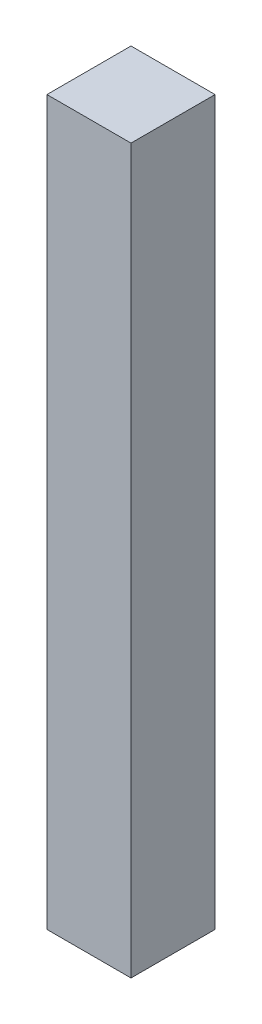
ISO-10303-21;
HEADER;
FILE_DESCRIPTION(('STEP AP214'),'2;1');
FILE_NAME('part.step','',(''),(''),'','','');
FILE_SCHEMA(('AUTOMOTIVE_DESIGN { 1 0 10303 214 1 1 1 1 }'));
ENDSEC;
DATA;
#1=APPLICATION_CONTEXT('core data for automotive mechanical design processes');
#2=APPLICATION_PROTOCOL_DEFINITION('international standard','automotive_design',2000,#1);
#3=PRODUCT_CONTEXT('',#1,'mechanical');
#4=PRODUCT('Part','Part','',(#3));
#5=PRODUCT_RELATED_PRODUCT_CATEGORY('part','',(#4));
#6=PRODUCT_DEFINITION_FORMATION('','',#4);
#7=PRODUCT_DEFINITION_CONTEXT('part definition',#1,'design');
#8=PRODUCT_DEFINITION('design','',#6,#7);
#9=PRODUCT_DEFINITION_SHAPE('','',#8);
#10=(LENGTH_UNIT() NAMED_UNIT(*) SI_UNIT(.MILLI.,.METRE.));
#11=(NAMED_UNIT(*) PLANE_ANGLE_UNIT() SI_UNIT($,.RADIAN.));
#12=(NAMED_UNIT(*) SI_UNIT($,.STERADIAN.) SOLID_ANGLE_UNIT());
#13=UNCERTAINTY_MEASURE_WITH_UNIT(LENGTH_MEASURE(1.E-05),#10,'distance_accuracy_value','');
#14=(GEOMETRIC_REPRESENTATION_CONTEXT(3) GLOBAL_UNCERTAINTY_ASSIGNED_CONTEXT((#13)) GLOBAL_UNIT_ASSIGNED_CONTEXT((#10,
#11,#12)) REPRESENTATION_CONTEXT('',''));
#15=CARTESIAN_POINT('',(0.,0.,0.));
#16=DIRECTION('',(0.,0.,1.));
#17=DIRECTION('',(1.,0.,0.));
#18=AXIS2_PLACEMENT_3D('',#15,#16,#17);
#19=CARTESIAN_POINT('',(0.,86.,0.));
#20=DIRECTION('',(1.,0.,0.));
#21=DIRECTION('',(0.,0.,-1.));
#22=AXIS2_PLACEMENT_3D('',#19,#20,#21);
#23=PLANE('',#22);
#24=DIRECTION('',(0.,0.,1.));
#25=VECTOR('',#24,1.);
#26=CARTESIAN_POINT('',(0.,0.,0.));
#27=LINE('',#26,#25);
#28=CARTESIAN_POINT('',(0.,0.,0.));
#29=VERTEX_POINT('',#28);
#30=CARTESIAN_POINT('',(0.,0.,10.));
#31=VERTEX_POINT('',#30);
#32=EDGE_CURVE('E96',#29,#31,#27,.T.);
#33=ORIENTED_EDGE('',*,*,#32,.T.);
#34=DIRECTION('',(0.,-1.,0.));
#35=VECTOR('',#34,1.);
#36=CARTESIAN_POINT('',(0.,86.,10.));
#37=LINE('',#36,#35);
#38=CARTESIAN_POINT('',(0.,86.,10.));
#39=VERTEX_POINT('',#38);
#40=EDGE_CURVE('E11',#39,#31,#37,.T.);
#41=ORIENTED_EDGE('',*,*,#40,.F.);
#42=DIRECTION('',(0.,0.,1.));
#43=VECTOR('',#42,1.);
#44=CARTESIAN_POINT('',(0.,86.,0.));
#45=LINE('',#44,#43);
#46=CARTESIAN_POINT('',(0.,86.,0.));
#47=VERTEX_POINT('',#46);
#48=EDGE_CURVE('E84',#47,#39,#45,.T.);
#49=ORIENTED_EDGE('',*,*,#48,.F.);
#50=DIRECTION('',(0.,-1.,0.));
#51=VECTOR('',#50,1.);
#52=CARTESIAN_POINT('',(0.,86.,0.));
#53=LINE('',#52,#51);
#54=EDGE_CURVE('E92',#47,#29,#53,.T.);
#55=ORIENTED_EDGE('',*,*,#54,.T.);
#56=EDGE_LOOP('',(#33,#41,#49,#55));
#57=FACE_BOUND('',#56,.T.);
#58=ADVANCED_FACE('F33',(#57),#23,.F.);
#59=CARTESIAN_POINT('',(0.,86.,10.));
#60=DIRECTION('',(0.,0.,-1.));
#61=DIRECTION('',(-1.,0.,0.));
#62=AXIS2_PLACEMENT_3D('',#59,#60,#61);
#63=PLANE('',#62);
#64=DIRECTION('',(1.,0.,0.));
#65=VECTOR('',#64,1.);
#66=CARTESIAN_POINT('',(0.,0.,10.));
#67=LINE('',#66,#65);
#68=CARTESIAN_POINT('',(10.,0.,10.));
#69=VERTEX_POINT('',#68);
#70=EDGE_CURVE('E88',#31,#69,#67,.T.);
#71=ORIENTED_EDGE('',*,*,#70,.T.);
#72=DIRECTION('',(0.,-1.,0.));
#73=VECTOR('',#72,1.);
#74=CARTESIAN_POINT('',(10.,86.,10.));
#75=LINE('',#74,#73);
#76=CARTESIAN_POINT('',(10.,86.,10.));
#77=VERTEX_POINT('',#76);
#78=EDGE_CURVE('E41',#77,#69,#75,.T.);
#79=ORIENTED_EDGE('',*,*,#78,.F.);
#80=DIRECTION('',(1.,0.,0.));
#81=VECTOR('',#80,1.);
#82=CARTESIAN_POINT('',(0.,86.,10.));
#83=LINE('',#82,#81);
#84=EDGE_CURVE('E79',#39,#77,#83,.T.);
#85=ORIENTED_EDGE('',*,*,#84,.F.);
#86=ORIENTED_EDGE('',*,*,#40,.T.);
#87=EDGE_LOOP('',(#71,#79,#85,#86));
#88=FACE_BOUND('',#87,.T.);
#89=ADVANCED_FACE('F87',(#88),#63,.F.);
#90=CARTESIAN_POINT('',(10.,86.,0.));
#91=DIRECTION('',(-1.,0.,0.));
#92=DIRECTION('',(0.,0.,1.));
#93=AXIS2_PLACEMENT_3D('',#90,#91,#92);
#94=PLANE('',#93);
#95=DIRECTION('',(0.,0.,-1.));
#96=VECTOR('',#95,1.);
#97=CARTESIAN_POINT('',(10.,0.,0.));
#98=LINE('',#97,#96);
#99=CARTESIAN_POINT('',(10.,0.,0.));
#100=VERTEX_POINT('',#99);
#101=EDGE_CURVE('E66',#69,#100,#98,.T.);
#102=ORIENTED_EDGE('',*,*,#101,.T.);
#103=DIRECTION('',(0.,-1.,0.));
#104=VECTOR('',#103,1.);
#105=CARTESIAN_POINT('',(10.,86.,0.));
#106=LINE('',#105,#104);
#107=CARTESIAN_POINT('',(10.,86.,0.));
#108=VERTEX_POINT('',#107);
#109=EDGE_CURVE('E89',#108,#100,#106,.T.);
#110=ORIENTED_EDGE('',*,*,#109,.F.);
#111=DIRECTION('',(0.,0.,-1.));
#112=VECTOR('',#111,1.);
#113=CARTESIAN_POINT('',(10.,86.,0.));
#114=LINE('',#113,#112);
#115=EDGE_CURVE('E82',#77,#108,#114,.T.);
#116=ORIENTED_EDGE('',*,*,#115,.F.);
#117=ORIENTED_EDGE('',*,*,#78,.T.);
#118=EDGE_LOOP('',(#102,#110,#116,#117));
#119=FACE_BOUND('',#118,.T.);
#120=ADVANCED_FACE('F90',(#119),#94,.F.);
#121=CARTESIAN_POINT('',(0.,86.,0.));
#122=DIRECTION('',(0.,0.,1.));
#123=DIRECTION('',(1.,0.,0.));
#124=AXIS2_PLACEMENT_3D('',#121,#122,#123);
#125=PLANE('',#124);
#126=DIRECTION('',(-1.,0.,0.));
#127=VECTOR('',#126,1.);
#128=CARTESIAN_POINT('',(0.,0.,0.));
#129=LINE('',#128,#127);
#130=EDGE_CURVE('E72',#100,#29,#129,.T.);
#131=ORIENTED_EDGE('',*,*,#130,.T.);
#132=ORIENTED_EDGE('',*,*,#54,.F.);
#133=DIRECTION('',(-1.,0.,0.));
#134=VECTOR('',#133,1.);
#135=CARTESIAN_POINT('',(0.,86.,0.));
#136=LINE('',#135,#134);
#137=EDGE_CURVE('E49',#108,#47,#136,.T.);
#138=ORIENTED_EDGE('',*,*,#137,.F.);
#139=ORIENTED_EDGE('',*,*,#109,.T.);
#140=EDGE_LOOP('',(#131,#132,#138,#139));
#141=FACE_BOUND('',#140,.T.);
#142=ADVANCED_FACE('F103',(#141),#125,.F.);
#143=CARTESIAN_POINT('',(0.,86.,0.));
#144=DIRECTION('',(0.,1.,0.));
#145=DIRECTION('',(0.,0.,1.));
#146=AXIS2_PLACEMENT_3D('',#143,#144,#145);
#147=PLANE('',#146);
#148=ORIENTED_EDGE('',*,*,#48,.T.);
#149=ORIENTED_EDGE('',*,*,#84,.T.);
#150=ORIENTED_EDGE('',*,*,#115,.T.);
#151=ORIENTED_EDGE('',*,*,#137,.T.);
#152=EDGE_LOOP('',(#148,#149,#150,#151));
#153=FACE_BOUND('',#152,.T.);
#154=ADVANCED_FACE('F80',(#153),#147,.T.);
#155=CARTESIAN_POINT('',(0.,0.,0.));
#156=DIRECTION('',(0.,1.,0.));
#157=DIRECTION('',(0.,0.,1.));
#158=AXIS2_PLACEMENT_3D('',#155,#156,#157);
#159=PLANE('',#158);
#160=ORIENTED_EDGE('',*,*,#32,.F.);
#161=ORIENTED_EDGE('',*,*,#130,.F.);
#162=ORIENTED_EDGE('',*,*,#101,.F.);
#163=ORIENTED_EDGE('',*,*,#70,.F.);
#164=EDGE_LOOP('',(#160,#161,#162,#163));
#165=FACE_BOUND('',#164,.T.);
#166=ADVANCED_FACE('F106',(#165),#159,.F.);
#167=CLOSED_SHELL('',(#58,#89,#120,#142,#154,#166));
#168=MANIFOLD_SOLID_BREP('B2',#167);
#169=ADVANCED_BREP_SHAPE_REPRESENTATION('',(#18,#168),#14);
#170=SHAPE_DEFINITION_REPRESENTATION(#9,#169);
ENDSEC;
END-ISO-10303-21;
